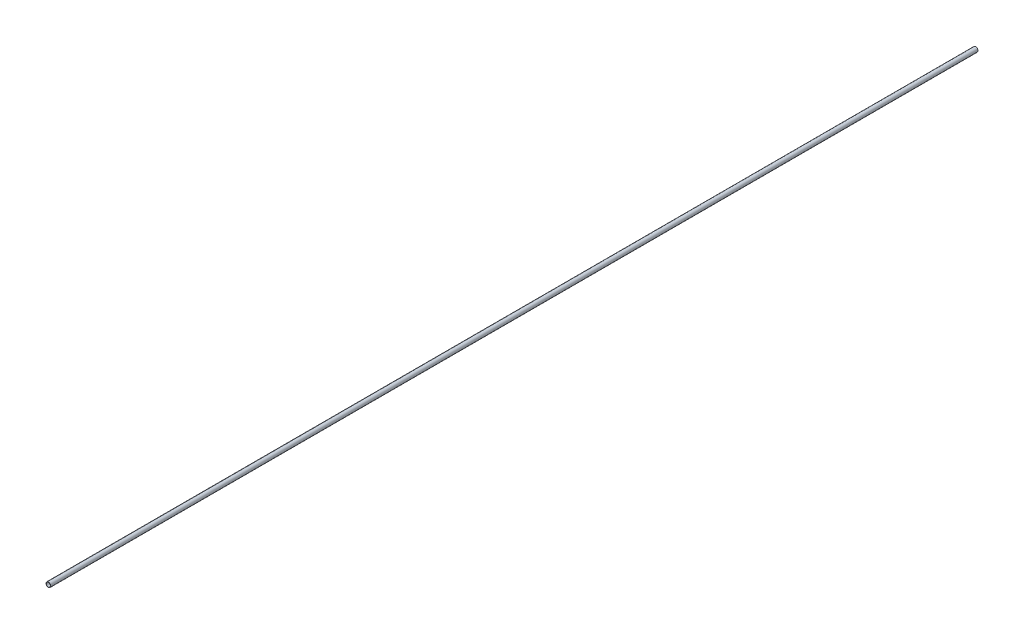
ISO-10303-21;
HEADER;
FILE_DESCRIPTION(('STEP AP214'),'2;1');
FILE_NAME('part.step','',(''),(''),'','','');
FILE_SCHEMA(('AUTOMOTIVE_DESIGN { 1 0 10303 214 1 1 1 1 }'));
ENDSEC;
DATA;
#1=APPLICATION_CONTEXT('core data for automotive mechanical design processes');
#2=APPLICATION_PROTOCOL_DEFINITION('international standard','automotive_design',2000,#1);
#3=PRODUCT_CONTEXT('',#1,'mechanical');
#4=PRODUCT('Part','Part','',(#3));
#5=PRODUCT_RELATED_PRODUCT_CATEGORY('part','',(#4));
#6=PRODUCT_DEFINITION_FORMATION('','',#4);
#7=PRODUCT_DEFINITION_CONTEXT('part definition',#1,'design');
#8=PRODUCT_DEFINITION('design','',#6,#7);
#9=PRODUCT_DEFINITION_SHAPE('','',#8);
#10=(LENGTH_UNIT() NAMED_UNIT(*) SI_UNIT(.MILLI.,.METRE.));
#11=(NAMED_UNIT(*) PLANE_ANGLE_UNIT() SI_UNIT($,.RADIAN.));
#12=(NAMED_UNIT(*) SI_UNIT($,.STERADIAN.) SOLID_ANGLE_UNIT());
#13=UNCERTAINTY_MEASURE_WITH_UNIT(LENGTH_MEASURE(1.E-05),#10,'distance_accuracy_value','');
#14=(GEOMETRIC_REPRESENTATION_CONTEXT(3) GLOBAL_UNCERTAINTY_ASSIGNED_CONTEXT((#13)) GLOBAL_UNIT_ASSIGNED_CONTEXT((#10,
#11,#12)) REPRESENTATION_CONTEXT('',''));
#15=CARTESIAN_POINT('',(0.,0.,0.));
#16=DIRECTION('',(0.,0.,1.));
#17=DIRECTION('',(1.,0.,0.));
#18=AXIS2_PLACEMENT_3D('',#15,#16,#17);
#19=CARTESIAN_POINT('',(0.,0.,1000.));
#20=DIRECTION('',(0.,0.,1.));
#21=DIRECTION('',(1.,0.,0.));
#22=AXIS2_PLACEMENT_3D('',#19,#20,#21);
#23=PLANE('',#22);
#24=CARTESIAN_POINT('',(0.,0.,1000.));
#25=DIRECTION('',(0.,0.,1.));
#26=DIRECTION('',(1.,0.,0.));
#27=AXIS2_PLACEMENT_3D('',#24,#25,#26);
#28=CIRCLE('',#27,2.53);
#29=CARTESIAN_POINT('',(2.53,0.,1000.));
#30=VERTEX_POINT('',#29);
#31=EDGE_CURVE('E11',#30,#30,#28,.T.);
#32=ORIENTED_EDGE('',*,*,#31,.T.);
#33=EDGE_LOOP('',(#32));
#34=FACE_BOUND('',#33,.T.);
#35=CARTESIAN_POINT('',(0.,0.,1000.));
#36=DIRECTION('',(0.,0.,1.));
#37=DIRECTION('',(1.,0.,0.));
#38=AXIS2_PLACEMENT_3D('',#35,#36,#37);
#39=CIRCLE('',#38,2.23);
#40=CARTESIAN_POINT('',(2.23,0.,1000.));
#41=VERTEX_POINT('',#40);
#42=EDGE_CURVE('E48',#41,#41,#39,.T.);
#43=ORIENTED_EDGE('',*,*,#42,.F.);
#44=EDGE_LOOP('',(#43));
#45=FACE_BOUND('',#44,.T.);
#46=ADVANCED_FACE('F37',(#34,#45),#23,.T.);
#47=CARTESIAN_POINT('',(0.,0.,0.));
#48=DIRECTION('',(0.,0.,1.));
#49=DIRECTION('',(1.,0.,0.));
#50=AXIS2_PLACEMENT_3D('',#47,#48,#49);
#51=PLANE('',#50);
#52=CARTESIAN_POINT('',(0.,0.,0.));
#53=DIRECTION('',(0.,0.,1.));
#54=DIRECTION('',(1.,0.,0.));
#55=AXIS2_PLACEMENT_3D('',#52,#53,#54);
#56=CIRCLE('',#55,2.53);
#57=CARTESIAN_POINT('',(2.53,0.,0.));
#58=VERTEX_POINT('',#57);
#59=EDGE_CURVE('E41',#58,#58,#56,.T.);
#60=ORIENTED_EDGE('',*,*,#59,.F.);
#61=EDGE_LOOP('',(#60));
#62=FACE_BOUND('',#61,.T.);
#63=CARTESIAN_POINT('',(0.,0.,0.));
#64=DIRECTION('',(0.,0.,1.));
#65=DIRECTION('',(1.,0.,0.));
#66=AXIS2_PLACEMENT_3D('',#63,#64,#65);
#67=CIRCLE('',#66,2.23);
#68=CARTESIAN_POINT('',(2.23,0.,0.));
#69=VERTEX_POINT('',#68);
#70=EDGE_CURVE('E50',#69,#69,#67,.T.);
#71=ORIENTED_EDGE('',*,*,#70,.T.);
#72=EDGE_LOOP('',(#71));
#73=FACE_BOUND('',#72,.T.);
#74=ADVANCED_FACE('F60',(#62,#73),#51,.F.);
#75=CARTESIAN_POINT('',(0.,0.,1000.));
#76=DIRECTION('',(0.,0.,-1.));
#77=DIRECTION('',(-1.,0.,0.));
#78=AXIS2_PLACEMENT_3D('',#75,#76,#77);
#79=CYLINDRICAL_SURFACE('',#78,2.53);
#80=ORIENTED_EDGE('',*,*,#31,.F.);
#81=EDGE_LOOP('',(#80));
#82=FACE_BOUND('',#81,.T.);
#83=ORIENTED_EDGE('',*,*,#59,.T.);
#84=EDGE_LOOP('',(#83));
#85=FACE_BOUND('',#84,.T.);
#86=ADVANCED_FACE('F39',(#82,#85),#79,.T.);
#87=CARTESIAN_POINT('',(0.,0.,1000.));
#88=DIRECTION('',(0.,0.,-1.));
#89=DIRECTION('',(-1.,0.,0.));
#90=AXIS2_PLACEMENT_3D('',#87,#88,#89);
#91=CYLINDRICAL_SURFACE('',#90,2.23);
#92=ORIENTED_EDGE('',*,*,#42,.T.);
#93=EDGE_LOOP('',(#92));
#94=FACE_BOUND('',#93,.T.);
#95=ORIENTED_EDGE('',*,*,#70,.F.);
#96=EDGE_LOOP('',(#95));
#97=FACE_BOUND('',#96,.T.);
#98=ADVANCED_FACE('F56',(#94,#97),#91,.F.);
#99=CLOSED_SHELL('',(#46,#74,#86,#98));
#100=MANIFOLD_SOLID_BREP('B2',#99);
#101=ADVANCED_BREP_SHAPE_REPRESENTATION('',(#18,#100),#14);
#102=SHAPE_DEFINITION_REPRESENTATION(#9,#101);
ENDSEC;
END-ISO-10303-21;
